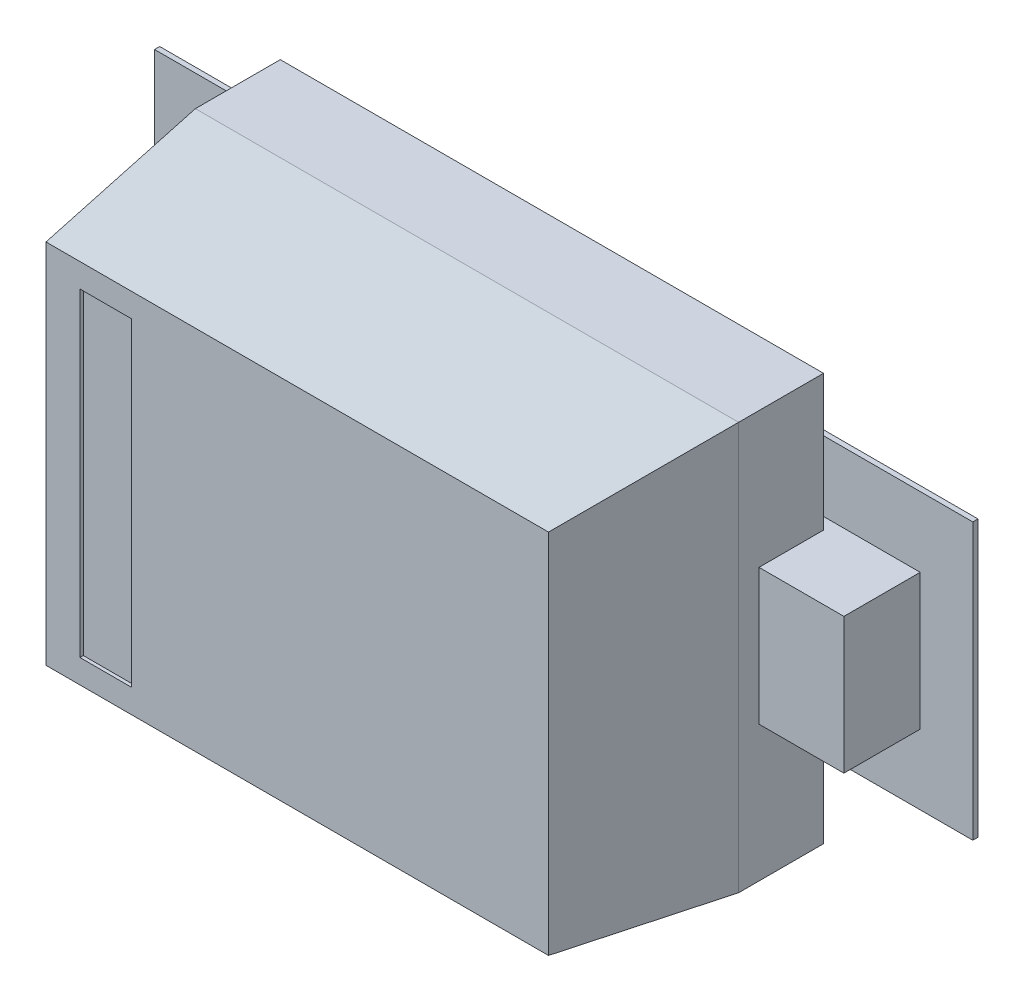
ISO-10303-21;
HEADER;
FILE_DESCRIPTION(('STEP AP214'),'2;1');
FILE_NAME('part.step','',(''),(''),'','','');
FILE_SCHEMA(('AUTOMOTIVE_DESIGN { 1 0 10303 214 1 1 1 1 }'));
ENDSEC;
DATA;
#1=APPLICATION_CONTEXT('core data for automotive mechanical design processes');
#2=APPLICATION_PROTOCOL_DEFINITION('international standard','automotive_design',2000,#1);
#3=PRODUCT_CONTEXT('',#1,'mechanical');
#4=PRODUCT('Part','Part','',(#3));
#5=PRODUCT_RELATED_PRODUCT_CATEGORY('part','',(#4));
#6=PRODUCT_DEFINITION_FORMATION('','',#4);
#7=PRODUCT_DEFINITION_CONTEXT('part definition',#1,'design');
#8=PRODUCT_DEFINITION('design','',#6,#7);
#9=PRODUCT_DEFINITION_SHAPE('','',#8);
#10=(LENGTH_UNIT() NAMED_UNIT(*) SI_UNIT(.MILLI.,.METRE.));
#11=(NAMED_UNIT(*) PLANE_ANGLE_UNIT() SI_UNIT($,.RADIAN.));
#12=(NAMED_UNIT(*) SI_UNIT($,.STERADIAN.) SOLID_ANGLE_UNIT());
#13=UNCERTAINTY_MEASURE_WITH_UNIT(LENGTH_MEASURE(1.E-05),#10,'distance_accuracy_value','');
#14=(GEOMETRIC_REPRESENTATION_CONTEXT(3) GLOBAL_UNCERTAINTY_ASSIGNED_CONTEXT((#13)) GLOBAL_UNIT_ASSIGNED_CONTEXT((#10,
#11,#12)) REPRESENTATION_CONTEXT('',''));
#15=CARTESIAN_POINT('',(0.,0.,0.));
#16=DIRECTION('',(0.,0.,1.));
#17=DIRECTION('',(1.,0.,0.));
#18=AXIS2_PLACEMENT_3D('',#15,#16,#17);
#19=CARTESIAN_POINT('',(-0.525,-0.1,0.0762));
#20=DIRECTION('',(-1.,0.,0.));
#21=DIRECTION('',(0.,0.,1.));
#22=AXIS2_PLACEMENT_3D('',#19,#20,#21);
#23=PLANE('',#22);
#24=DIRECTION('',(0.,1.,0.));
#25=VECTOR('',#24,1.);
#26=CARTESIAN_POINT('',(-0.525,-0.1,0.08382));
#27=LINE('',#26,#25);
#28=CARTESIAN_POINT('',(-0.525,-0.1,0.08382));
#29=VERTEX_POINT('',#28);
#30=CARTESIAN_POINT('',(-0.525,0.1,0.08382));
#31=VERTEX_POINT('',#30);
#32=EDGE_CURVE('E300',#29,#31,#27,.T.);
#33=ORIENTED_EDGE('',*,*,#32,.F.);
#34=DIRECTION('',(0.,0.,1.));
#35=VECTOR('',#34,1.);
#36=CARTESIAN_POINT('',(-0.525,-0.1,0.08382));
#37=LINE('',#36,#35);
#38=CARTESIAN_POINT('',(-0.525,-0.1,0.1962));
#39=VERTEX_POINT('',#38);
#40=EDGE_CURVE('E282',#29,#39,#37,.T.);
#41=ORIENTED_EDGE('',*,*,#40,.T.);
#42=DIRECTION('',(0.,1.,0.));
#43=VECTOR('',#42,1.);
#44=CARTESIAN_POINT('',(-0.525,-0.1,0.1962));
#45=LINE('',#44,#43);
#46=CARTESIAN_POINT('',(-0.525,0.1,0.1962));
#47=VERTEX_POINT('',#46);
#48=EDGE_CURVE('E11',#39,#47,#45,.T.);
#49=ORIENTED_EDGE('',*,*,#48,.T.);
#50=DIRECTION('',(0.,0.,1.));
#51=VECTOR('',#50,1.);
#52=CARTESIAN_POINT('',(-0.525,0.1,0.08382));
#53=LINE('',#52,#51);
#54=EDGE_CURVE('E106',#31,#47,#53,.T.);
#55=ORIENTED_EDGE('',*,*,#54,.F.);
#56=EDGE_LOOP('',(#33,#41,#49,#55));
#57=FACE_BOUND('',#56,.T.);
#58=ADVANCED_FACE('F17',(#57),#23,.T.);
#59=CARTESIAN_POINT('',(-0.525,-0.1,0.1962));
#60=DIRECTION('',(0.,0.,1.));
#61=DIRECTION('',(1.,0.,0.));
#62=AXIS2_PLACEMENT_3D('',#59,#60,#61);
#63=PLANE('',#62);
#64=DIRECTION('',(1.,0.,0.));
#65=VECTOR('',#64,1.);
#66=CARTESIAN_POINT('',(-0.525,-0.1,0.1962));
#67=LINE('',#66,#65);
#68=CARTESIAN_POINT('',(-0.4,-0.1,0.1962));
#69=VERTEX_POINT('',#68);
#70=EDGE_CURVE('E278',#39,#69,#67,.T.);
#71=ORIENTED_EDGE('',*,*,#70,.T.);
#72=DIRECTION('',(0.,1.,0.));
#73=VECTOR('',#72,1.);
#74=CARTESIAN_POINT('',(-0.4,-0.1,0.1962));
#75=LINE('',#74,#73);
#76=CARTESIAN_POINT('',(-0.4,0.1,0.1962));
#77=VERTEX_POINT('',#76);
#78=EDGE_CURVE('E389',#69,#77,#75,.T.);
#79=ORIENTED_EDGE('',*,*,#78,.T.);
#80=DIRECTION('',(1.,0.,0.));
#81=VECTOR('',#80,1.);
#82=CARTESIAN_POINT('',(-0.525,0.1,0.1962));
#83=LINE('',#82,#81);
#84=EDGE_CURVE('E433',#47,#77,#83,.T.);
#85=ORIENTED_EDGE('',*,*,#84,.F.);
#86=ORIENTED_EDGE('',*,*,#48,.F.);
#87=EDGE_LOOP('',(#71,#79,#85,#86));
#88=FACE_BOUND('',#87,.T.);
#89=ADVANCED_FACE('F567',(#88),#63,.T.);
#90=CARTESIAN_POINT('',(-0.325,-0.1,0.1962));
#91=DIRECTION('',(1.,0.,0.));
#92=DIRECTION('',(0.,1.,0.));
#93=AXIS2_PLACEMENT_3D('',#90,#91,#92);
#94=PLANE('',#93);
#95=DIRECTION('',(0.,1.,0.));
#96=VECTOR('',#95,1.);
#97=CARTESIAN_POINT('',(-0.325,-0.1,0.08382));
#98=LINE('',#97,#96);
#99=CARTESIAN_POINT('',(-0.325,-0.1,0.08382));
#100=VERTEX_POINT('',#99);
#101=CARTESIAN_POINT('',(-0.325,0.1,0.08382));
#102=VERTEX_POINT('',#101);
#103=EDGE_CURVE('E272',#100,#102,#98,.T.);
#104=ORIENTED_EDGE('',*,*,#103,.T.);
#105=DIRECTION('',(0.,0.,-1.));
#106=VECTOR('',#105,1.);
#107=CARTESIAN_POINT('',(-0.325,0.1,0.1012));
#108=LINE('',#107,#106);
#109=CARTESIAN_POINT('',(-0.325,0.1,0.1012));
#110=VERTEX_POINT('',#109);
#111=EDGE_CURVE('E28',#110,#102,#108,.T.);
#112=ORIENTED_EDGE('',*,*,#111,.F.);
#113=DIRECTION('',(0.,1.,0.));
#114=VECTOR('',#113,1.);
#115=CARTESIAN_POINT('',(-0.325,-0.1,0.1012));
#116=LINE('',#115,#114);
#117=CARTESIAN_POINT('',(-0.325,-0.1,0.1012));
#118=VERTEX_POINT('',#117);
#119=EDGE_CURVE('E437',#118,#110,#116,.T.);
#120=ORIENTED_EDGE('',*,*,#119,.F.);
#121=DIRECTION('',(0.,0.,-1.));
#122=VECTOR('',#121,1.);
#123=CARTESIAN_POINT('',(-0.325,-0.1,0.1012));
#124=LINE('',#123,#122);
#125=EDGE_CURVE('E283',#118,#100,#124,.T.);
#126=ORIENTED_EDGE('',*,*,#125,.T.);
#127=EDGE_LOOP('',(#104,#112,#120,#126));
#128=FACE_BOUND('',#127,.T.);
#129=ADVANCED_FACE('F640',(#128),#94,.T.);
#130=CARTESIAN_POINT('',(0.325,-0.1,0.0762));
#131=DIRECTION('',(-1.,0.,0.));
#132=DIRECTION('',(0.,0.,1.));
#133=AXIS2_PLACEMENT_3D('',#130,#131,#132);
#134=PLANE('',#133);
#135=DIRECTION('',(0.,1.,0.));
#136=VECTOR('',#135,1.);
#137=CARTESIAN_POINT('',(0.325,-0.1,0.08382));
#138=LINE('',#137,#136);
#139=CARTESIAN_POINT('',(0.325,-0.1,0.08382));
#140=VERTEX_POINT('',#139);
#141=CARTESIAN_POINT('',(0.325,0.1,0.08382));
#142=VERTEX_POINT('',#141);
#143=EDGE_CURVE('E324',#140,#142,#138,.T.);
#144=ORIENTED_EDGE('',*,*,#143,.F.);
#145=DIRECTION('',(0.,0.,1.));
#146=VECTOR('',#145,1.);
#147=CARTESIAN_POINT('',(0.325,-0.1,0.08382));
#148=LINE('',#147,#146);
#149=CARTESIAN_POINT('',(0.325,-0.1,0.1012));
#150=VERTEX_POINT('',#149);
#151=EDGE_CURVE('E328',#140,#150,#148,.T.);
#152=ORIENTED_EDGE('',*,*,#151,.T.);
#153=DIRECTION('',(0.,1.,0.));
#154=VECTOR('',#153,1.);
#155=CARTESIAN_POINT('',(0.325,-0.1,0.1012));
#156=LINE('',#155,#154);
#157=CARTESIAN_POINT('',(0.325,0.1,0.1012));
#158=VERTEX_POINT('',#157);
#159=EDGE_CURVE('E443',#150,#158,#156,.T.);
#160=ORIENTED_EDGE('',*,*,#159,.T.);
#161=DIRECTION('',(0.,0.,1.));
#162=VECTOR('',#161,1.);
#163=CARTESIAN_POINT('',(0.325,0.1,0.08382));
#164=LINE('',#163,#162);
#165=EDGE_CURVE('E366',#142,#158,#164,.T.);
#166=ORIENTED_EDGE('',*,*,#165,.F.);
#167=EDGE_LOOP('',(#144,#152,#160,#166));
#168=FACE_BOUND('',#167,.T.);
#169=ADVANCED_FACE('F666',(#168),#134,.T.);
#170=CARTESIAN_POINT('',(0.,0.1,0.));
#171=DIRECTION('',(0.,1.,0.));
#172=DIRECTION('',(1.,0.,0.));
#173=AXIS2_PLACEMENT_3D('',#170,#171,#172);
#174=PLANE('',#173);
#175=DIRECTION('',(-1.,0.,0.));
#176=VECTOR('',#175,1.);
#177=CARTESIAN_POINT('',(-0.325,0.1,0.08382));
#178=LINE('',#177,#176);
#179=EDGE_CURVE('E304',#102,#31,#178,.T.);
#180=ORIENTED_EDGE('',*,*,#179,.T.);
#181=ORIENTED_EDGE('',*,*,#54,.T.);
#182=ORIENTED_EDGE('',*,*,#84,.T.);
#183=DIRECTION('',(0.,0.,1.));
#184=VECTOR('',#183,1.);
#185=CARTESIAN_POINT('',(-0.4,0.1,0.1012));
#186=LINE('',#185,#184);
#187=CARTESIAN_POINT('',(-0.4,0.1,0.1012));
#188=VERTEX_POINT('',#187);
#189=EDGE_CURVE('E266',#188,#77,#186,.T.);
#190=ORIENTED_EDGE('',*,*,#189,.F.);
#191=DIRECTION('',(1.,0.,0.));
#192=VECTOR('',#191,1.);
#193=CARTESIAN_POINT('',(-0.4,0.1,0.1012));
#194=LINE('',#193,#192);
#195=EDGE_CURVE('E442',#188,#110,#194,.T.);
#196=ORIENTED_EDGE('',*,*,#195,.T.);
#197=ORIENTED_EDGE('',*,*,#111,.T.);
#198=EDGE_LOOP('',(#180,#181,#182,#190,#196,#197));
#199=FACE_BOUND('',#198,.T.);
#200=ADVANCED_FACE('F663',(#199),#174,.T.);
#201=CARTESIAN_POINT('',(0.,0.1,0.));
#202=DIRECTION('',(0.,1.,0.));
#203=DIRECTION('',(1.,0.,0.));
#204=AXIS2_PLACEMENT_3D('',#201,#202,#203);
#205=PLANE('',#204);
#206=DIRECTION('',(-1.,0.,0.));
#207=VECTOR('',#206,1.);
#208=CARTESIAN_POINT('',(0.525,0.1,0.08382));
#209=LINE('',#208,#207);
#210=CARTESIAN_POINT('',(0.525,0.1,0.08382));
#211=VERTEX_POINT('',#210);
#212=EDGE_CURVE('E311',#211,#142,#209,.T.);
#213=ORIENTED_EDGE('',*,*,#212,.T.);
#214=ORIENTED_EDGE('',*,*,#165,.T.);
#215=DIRECTION('',(1.,0.,0.));
#216=VECTOR('',#215,1.);
#217=CARTESIAN_POINT('',(0.325,0.1,0.1012));
#218=LINE('',#217,#216);
#219=CARTESIAN_POINT('',(0.4,0.1,0.1012));
#220=VERTEX_POINT('',#219);
#221=EDGE_CURVE('E448',#158,#220,#218,.T.);
#222=ORIENTED_EDGE('',*,*,#221,.T.);
#223=DIRECTION('',(0.,0.,-1.));
#224=VECTOR('',#223,1.);
#225=CARTESIAN_POINT('',(0.4,0.1,0.1962));
#226=LINE('',#225,#224);
#227=CARTESIAN_POINT('',(0.4,0.1,0.1962));
#228=VERTEX_POINT('',#227);
#229=EDGE_CURVE('E216',#228,#220,#226,.T.);
#230=ORIENTED_EDGE('',*,*,#229,.F.);
#231=DIRECTION('',(1.,0.,0.));
#232=VECTOR('',#231,1.);
#233=CARTESIAN_POINT('',(0.4,0.1,0.1962));
#234=LINE('',#233,#232);
#235=CARTESIAN_POINT('',(0.525,0.1,0.1962));
#236=VERTEX_POINT('',#235);
#237=EDGE_CURVE('E398',#228,#236,#234,.T.);
#238=ORIENTED_EDGE('',*,*,#237,.T.);
#239=DIRECTION('',(0.,0.,-1.));
#240=VECTOR('',#239,1.);
#241=CARTESIAN_POINT('',(0.525,0.1,0.1962));
#242=LINE('',#241,#240);
#243=EDGE_CURVE('E348',#236,#211,#242,.T.);
#244=ORIENTED_EDGE('',*,*,#243,.T.);
#245=EDGE_LOOP('',(#213,#214,#222,#230,#238,#244));
#246=FACE_BOUND('',#245,.T.);
#247=ADVANCED_FACE('F649',(#246),#205,.T.);
#248=CARTESIAN_POINT('',(0.,0.3,0.));
#249=DIRECTION('',(0.,1.,0.));
#250=DIRECTION('',(1.,0.,0.));
#251=AXIS2_PLACEMENT_3D('',#248,#249,#250);
#252=PLANE('',#251);
#253=DIRECTION('',(1.,0.,0.));
#254=VECTOR('',#253,1.);
#255=CARTESIAN_POINT('',(-0.4,0.3,0.2262));
#256=LINE('',#255,#254);
#257=CARTESIAN_POINT('',(-0.4,0.3,0.2262));
#258=VERTEX_POINT('',#257);
#259=CARTESIAN_POINT('',(0.4,0.3,0.2262));
#260=VERTEX_POINT('',#259);
#261=EDGE_CURVE('E358',#258,#260,#256,.T.);
#262=ORIENTED_EDGE('',*,*,#261,.T.);
#263=DIRECTION('',(0.,0.,-1.));
#264=VECTOR('',#263,1.);
#265=CARTESIAN_POINT('',(0.4,0.3,0.2262));
#266=LINE('',#265,#264);
#267=CARTESIAN_POINT('',(0.4,0.3,0.1012));
#268=VERTEX_POINT('',#267);
#269=EDGE_CURVE('E212',#260,#268,#266,.T.);
#270=ORIENTED_EDGE('',*,*,#269,.T.);
#271=DIRECTION('',(-1.,0.,0.));
#272=VECTOR('',#271,1.);
#273=CARTESIAN_POINT('',(0.4,0.3,0.1012));
#274=LINE('',#273,#272);
#275=CARTESIAN_POINT('',(-0.4,0.3,0.1012));
#276=VERTEX_POINT('',#275);
#277=EDGE_CURVE('E438',#268,#276,#274,.T.);
#278=ORIENTED_EDGE('',*,*,#277,.T.);
#279=DIRECTION('',(0.,0.,1.));
#280=VECTOR('',#279,1.);
#281=CARTESIAN_POINT('',(-0.4,0.3,0.1012));
#282=LINE('',#281,#280);
#283=EDGE_CURVE('E260',#276,#258,#282,.T.);
#284=ORIENTED_EDGE('',*,*,#283,.T.);
#285=EDGE_LOOP('',(#262,#270,#278,#284));
#286=FACE_BOUND('',#285,.T.);
#287=ADVANCED_FACE('F645',(#286),#252,.T.);
#288=CARTESIAN_POINT('',(0.,0.285,0.3512));
#289=DIRECTION('',(0.,0.992876838486925,0.119145220618403));
#290=DIRECTION('',(1.,0.,0.));
#291=AXIS2_PLACEMENT_3D('',#288,#289,#290);
#292=PLANE('',#291);
#293=ORIENTED_EDGE('',*,*,#261,.F.);
#294=DIRECTION('',(-0.118308451008796,0.118308451008796,-0.985903758406366));
#295=VECTOR('',#294,1.);
#296=CARTESIAN_POINT('',(-0.37,0.27,0.4762));
#297=LINE('',#296,#295);
#298=CARTESIAN_POINT('',(-0.37,0.27,0.4762));
#299=VERTEX_POINT('',#298);
#300=EDGE_CURVE('E261',#299,#258,#297,.T.);
#301=ORIENTED_EDGE('',*,*,#300,.F.);
#302=DIRECTION('',(1.,0.,0.));
#303=VECTOR('',#302,1.);
#304=CARTESIAN_POINT('',(-0.37,0.27,0.4762));
#305=LINE('',#304,#303);
#306=CARTESIAN_POINT('',(0.37,0.27,0.4762));
#307=VERTEX_POINT('',#306);
#308=EDGE_CURVE('E255',#299,#307,#305,.T.);
#309=ORIENTED_EDGE('',*,*,#308,.T.);
#310=DIRECTION('',(0.118308451008796,0.118308451008796,-0.985903758406366));
#311=VECTOR('',#310,1.);
#312=CARTESIAN_POINT('',(0.37,0.27,0.4762));
#313=LINE('',#312,#311);
#314=EDGE_CURVE('E355',#307,#260,#313,.T.);
#315=ORIENTED_EDGE('',*,*,#314,.T.);
#316=EDGE_LOOP('',(#293,#301,#309,#315));
#317=FACE_BOUND('',#316,.T.);
#318=ADVANCED_FACE('F648',(#317),#292,.T.);
#319=CARTESIAN_POINT('',(0.385,0.,0.3512));
#320=DIRECTION('',(0.992876838486925,0.,0.119145220618403));
#321=DIRECTION('',(0.,-1.,0.));
#322=AXIS2_PLACEMENT_3D('',#319,#320,#321);
#323=PLANE('',#322);
#324=DIRECTION('',(0.,-1.,0.));
#325=VECTOR('',#324,1.);
#326=CARTESIAN_POINT('',(0.4,0.3,0.2262));
#327=LINE('',#326,#325);
#328=CARTESIAN_POINT('',(0.4,-0.3,0.2262));
#329=VERTEX_POINT('',#328);
#330=EDGE_CURVE('E204',#260,#329,#327,.T.);
#331=ORIENTED_EDGE('',*,*,#330,.F.);
#332=ORIENTED_EDGE('',*,*,#314,.F.);
#333=DIRECTION('',(0.,-1.,0.));
#334=VECTOR('',#333,1.);
#335=CARTESIAN_POINT('',(0.37,0.27,0.4762));
#336=LINE('',#335,#334);
#337=CARTESIAN_POINT('',(0.37,-0.27,0.4762));
#338=VERTEX_POINT('',#337);
#339=EDGE_CURVE('E223',#307,#338,#336,.T.);
#340=ORIENTED_EDGE('',*,*,#339,.T.);
#341=DIRECTION('',(0.118308451008796,-0.118308451008796,-0.985903758406366));
#342=VECTOR('',#341,1.);
#343=CARTESIAN_POINT('',(0.37,-0.27,0.4762));
#344=LINE('',#343,#342);
#345=EDGE_CURVE('E220',#338,#329,#344,.T.);
#346=ORIENTED_EDGE('',*,*,#345,.T.);
#347=EDGE_LOOP('',(#331,#332,#340,#346));
#348=FACE_BOUND('',#347,.T.);
#349=ADVANCED_FACE('F221',(#348),#323,.T.);
#350=CARTESIAN_POINT('',(0.4,-0.3,0.4762));
#351=DIRECTION('',(1.,0.,0.));
#352=DIRECTION('',(0.,1.,0.));
#353=AXIS2_PLACEMENT_3D('',#350,#351,#352);
#354=PLANE('',#353);
#355=ORIENTED_EDGE('',*,*,#330,.T.);
#356=DIRECTION('',(0.,0.,-1.));
#357=VECTOR('',#356,1.);
#358=CARTESIAN_POINT('',(0.4,-0.3,0.2262));
#359=LINE('',#358,#357);
#360=CARTESIAN_POINT('',(0.4,-0.3,0.1012));
#361=VERTEX_POINT('',#360);
#362=EDGE_CURVE('E209',#329,#361,#359,.T.);
#363=ORIENTED_EDGE('',*,*,#362,.T.);
#364=DIRECTION('',(0.,1.,0.));
#365=VECTOR('',#364,1.);
#366=CARTESIAN_POINT('',(0.4,-0.3,0.1012));
#367=LINE('',#366,#365);
#368=CARTESIAN_POINT('',(0.4,-0.1,0.1012));
#369=VERTEX_POINT('',#368);
#370=EDGE_CURVE('E461',#361,#369,#367,.T.);
#371=ORIENTED_EDGE('',*,*,#370,.T.);
#372=DIRECTION('',(0.,0.,-1.));
#373=VECTOR('',#372,1.);
#374=CARTESIAN_POINT('',(0.4,-0.1,0.1962));
#375=LINE('',#374,#373);
#376=CARTESIAN_POINT('',(0.4,-0.1,0.1962));
#377=VERTEX_POINT('',#376);
#378=EDGE_CURVE('E332',#377,#369,#375,.T.);
#379=ORIENTED_EDGE('',*,*,#378,.F.);
#380=DIRECTION('',(0.,1.,0.));
#381=VECTOR('',#380,1.);
#382=CARTESIAN_POINT('',(0.4,-0.1,0.1962));
#383=LINE('',#382,#381);
#384=EDGE_CURVE('E217',#377,#228,#383,.T.);
#385=ORIENTED_EDGE('',*,*,#384,.T.);
#386=ORIENTED_EDGE('',*,*,#229,.T.);
#387=DIRECTION('',(0.,1.,0.));
#388=VECTOR('',#387,1.);
#389=CARTESIAN_POINT('',(0.4,0.1,0.1012));
#390=LINE('',#389,#388);
#391=EDGE_CURVE('E441',#220,#268,#390,.T.);
#392=ORIENTED_EDGE('',*,*,#391,.T.);
#393=ORIENTED_EDGE('',*,*,#269,.F.);
#394=EDGE_LOOP('',(#355,#363,#371,#379,#385,#386,#392,#393));
#395=FACE_BOUND('',#394,.T.);
#396=ADVANCED_FACE('F206',(#395),#354,.T.);
#397=CARTESIAN_POINT('',(0.325,-0.1,0.1962));
#398=DIRECTION('',(0.,0.,1.));
#399=DIRECTION('',(1.,0.,0.));
#400=AXIS2_PLACEMENT_3D('',#397,#398,#399);
#401=PLANE('',#400);
#402=DIRECTION('',(1.,0.,0.));
#403=VECTOR('',#402,1.);
#404=CARTESIAN_POINT('',(0.4,-0.1,0.1962));
#405=LINE('',#404,#403);
#406=CARTESIAN_POINT('',(0.525,-0.1,0.1962));
#407=VERTEX_POINT('',#406);
#408=EDGE_CURVE('E295',#377,#407,#405,.T.);
#409=ORIENTED_EDGE('',*,*,#408,.T.);
#410=DIRECTION('',(0.,1.,0.));
#411=VECTOR('',#410,1.);
#412=CARTESIAN_POINT('',(0.525,-0.1,0.1962));
#413=LINE('',#412,#411);
#414=EDGE_CURVE('E401',#407,#236,#413,.T.);
#415=ORIENTED_EDGE('',*,*,#414,.T.);
#416=ORIENTED_EDGE('',*,*,#237,.F.);
#417=ORIENTED_EDGE('',*,*,#384,.F.);
#418=EDGE_LOOP('',(#409,#415,#416,#417));
#419=FACE_BOUND('',#418,.T.);
#420=ADVANCED_FACE('F652',(#419),#401,.T.);
#421=CARTESIAN_POINT('',(0.525,-0.1,0.1962));
#422=DIRECTION('',(1.,0.,0.));
#423=DIRECTION('',(0.,1.,0.));
#424=AXIS2_PLACEMENT_3D('',#421,#422,#423);
#425=PLANE('',#424);
#426=DIRECTION('',(0.,1.,0.));
#427=VECTOR('',#426,1.);
#428=CARTESIAN_POINT('',(0.525,-0.1,0.08382));
#429=LINE('',#428,#427);
#430=CARTESIAN_POINT('',(0.525,-0.1,0.08382));
#431=VERTEX_POINT('',#430);
#432=EDGE_CURVE('E306',#431,#211,#429,.T.);
#433=ORIENTED_EDGE('',*,*,#432,.T.);
#434=ORIENTED_EDGE('',*,*,#243,.F.);
#435=ORIENTED_EDGE('',*,*,#414,.F.);
#436=DIRECTION('',(0.,0.,-1.));
#437=VECTOR('',#436,1.);
#438=CARTESIAN_POINT('',(0.525,-0.1,0.1962));
#439=LINE('',#438,#437);
#440=EDGE_CURVE('E291',#407,#431,#439,.T.);
#441=ORIENTED_EDGE('',*,*,#440,.T.);
#442=EDGE_LOOP('',(#433,#434,#435,#441));
#443=FACE_BOUND('',#442,.T.);
#444=ADVANCED_FACE('F630',(#443),#425,.T.);
#445=CARTESIAN_POINT('',(-0.2975102,-0.2029968,0.0762));
#446=DIRECTION('',(1.,0.,0.));
#447=DIRECTION('',(0.,1.,0.));
#448=AXIS2_PLACEMENT_3D('',#445,#446,#447);
#449=PLANE('',#448);
#450=DIRECTION('',(0.,1.,0.));
#451=VECTOR('',#450,1.);
#452=CARTESIAN_POINT('',(-0.2975102,-0.2029968,0.0762));
#453=LINE('',#452,#451);
#454=CARTESIAN_POINT('',(-0.2975102,-0.2029968,0.0762));
#455=VERTEX_POINT('',#454);
#456=CARTESIAN_POINT('',(-0.2975102,0.2029968,0.0762));
#457=VERTEX_POINT('',#456);
#458=EDGE_CURVE('E316',#455,#457,#453,.T.);
#459=ORIENTED_EDGE('',*,*,#458,.T.);
#460=DIRECTION('',(0.,0.,1.));
#461=VECTOR('',#460,1.);
#462=CARTESIAN_POINT('',(-0.2975102,0.2029968,0.0762));
#463=LINE('',#462,#461);
#464=CARTESIAN_POINT('',(-0.2975102,0.2029968,0.08382));
#465=VERTEX_POINT('',#464);
#466=EDGE_CURVE('E337',#457,#465,#463,.T.);
#467=ORIENTED_EDGE('',*,*,#466,.T.);
#468=DIRECTION('',(0.,1.,0.));
#469=VECTOR('',#468,1.);
#470=CARTESIAN_POINT('',(-0.2975102,-0.2029968,0.08382));
#471=LINE('',#470,#469);
#472=CARTESIAN_POINT('',(-0.2975102,-0.2029968,0.08382));
#473=VERTEX_POINT('',#472);
#474=EDGE_CURVE('E305',#473,#465,#471,.T.);
#475=ORIENTED_EDGE('',*,*,#474,.F.);
#476=DIRECTION('',(0.,0.,1.));
#477=VECTOR('',#476,1.);
#478=CARTESIAN_POINT('',(-0.2975102,-0.2029968,0.0762));
#479=LINE('',#478,#477);
#480=EDGE_CURVE('E123',#455,#473,#479,.T.);
#481=ORIENTED_EDGE('',*,*,#480,.F.);
#482=EDGE_LOOP('',(#459,#467,#475,#481));
#483=FACE_BOUND('',#482,.T.);
#484=ADVANCED_FACE('F605',(#483),#449,.T.);
#485=CARTESIAN_POINT('',(-0.602488,-0.2029968,0.0762));
#486=DIRECTION('',(0.,-1.,0.));
#487=DIRECTION('',(0.,0.,-1.));
#488=AXIS2_PLACEMENT_3D('',#485,#486,#487);
#489=PLANE('',#488);
#490=DIRECTION('',(1.,0.,0.));
#491=VECTOR('',#490,1.);
#492=CARTESIAN_POINT('',(-0.602488,-0.2029968,0.0762));
#493=LINE('',#492,#491);
#494=CARTESIAN_POINT('',(-0.602488,-0.2029968,0.0762));
#495=VERTEX_POINT('',#494);
#496=EDGE_CURVE('E385',#495,#455,#493,.T.);
#497=ORIENTED_EDGE('',*,*,#496,.T.);
#498=ORIENTED_EDGE('',*,*,#480,.T.);
#499=DIRECTION('',(1.,0.,0.));
#500=VECTOR('',#499,1.);
#501=CARTESIAN_POINT('',(-0.602488,-0.2029968,0.08382));
#502=LINE('',#501,#500);
#503=CARTESIAN_POINT('',(-0.602488,-0.2029968,0.08382));
#504=VERTEX_POINT('',#503);
#505=EDGE_CURVE('E381',#504,#473,#502,.T.);
#506=ORIENTED_EDGE('',*,*,#505,.F.);
#507=DIRECTION('',(0.,0.,1.));
#508=VECTOR('',#507,1.);
#509=CARTESIAN_POINT('',(-0.602488,-0.2029968,0.0762));
#510=LINE('',#509,#508);
#511=EDGE_CURVE('E349',#495,#504,#510,.T.);
#512=ORIENTED_EDGE('',*,*,#511,.F.);
#513=EDGE_LOOP('',(#497,#498,#506,#512));
#514=FACE_BOUND('',#513,.T.);
#515=ADVANCED_FACE('F620',(#514),#489,.T.);
#516=CARTESIAN_POINT('',(-0.602488,0.2029968,0.0762));
#517=DIRECTION('',(-1.,0.,0.));
#518=DIRECTION('',(0.,0.,1.));
#519=AXIS2_PLACEMENT_3D('',#516,#517,#518);
#520=PLANE('',#519);
#521=DIRECTION('',(0.,-1.,0.));
#522=VECTOR('',#521,1.);
#523=CARTESIAN_POINT('',(-0.602488,0.2029968,0.0762));
#524=LINE('',#523,#522);
#525=CARTESIAN_POINT('',(-0.602488,0.2029968,0.0762));
#526=VERTEX_POINT('',#525);
#527=EDGE_CURVE('E388',#526,#495,#524,.T.);
#528=ORIENTED_EDGE('',*,*,#527,.T.);
#529=ORIENTED_EDGE('',*,*,#511,.T.);
#530=DIRECTION('',(0.,-1.,0.));
#531=VECTOR('',#530,1.);
#532=CARTESIAN_POINT('',(-0.602488,0.2029968,0.08382));
#533=LINE('',#532,#531);
#534=CARTESIAN_POINT('',(-0.602488,0.2029968,0.08382));
#535=VERTEX_POINT('',#534);
#536=EDGE_CURVE('E341',#535,#504,#533,.T.);
#537=ORIENTED_EDGE('',*,*,#536,.F.);
#538=DIRECTION('',(0.,0.,1.));
#539=VECTOR('',#538,1.);
#540=CARTESIAN_POINT('',(-0.602488,0.2029968,0.0762));
#541=LINE('',#540,#539);
#542=EDGE_CURVE('E333',#526,#535,#541,.T.);
#543=ORIENTED_EDGE('',*,*,#542,.F.);
#544=EDGE_LOOP('',(#528,#529,#537,#543));
#545=FACE_BOUND('',#544,.T.);
#546=ADVANCED_FACE('F618',(#545),#520,.T.);
#547=CARTESIAN_POINT('',(0.2975102,0.2029968,0.0762));
#548=DIRECTION('',(-1.,0.,0.));
#549=DIRECTION('',(0.,0.,1.));
#550=AXIS2_PLACEMENT_3D('',#547,#548,#549);
#551=PLANE('',#550);
#552=DIRECTION('',(0.,-1.,0.));
#553=VECTOR('',#552,1.);
#554=CARTESIAN_POINT('',(0.2975102,0.2029968,0.0762));
#555=LINE('',#554,#553);
#556=CARTESIAN_POINT('',(0.2975102,0.2029968,0.0762));
#557=VERTEX_POINT('',#556);
#558=CARTESIAN_POINT('',(0.2975102,-0.2029968,0.0762));
#559=VERTEX_POINT('',#558);
#560=EDGE_CURVE('E312',#557,#559,#555,.T.);
#561=ORIENTED_EDGE('',*,*,#560,.T.);
#562=DIRECTION('',(0.,0.,1.));
#563=VECTOR('',#562,1.);
#564=CARTESIAN_POINT('',(0.2975102,-0.2029968,0.0762));
#565=LINE('',#564,#563);
#566=CARTESIAN_POINT('',(0.2975102,-0.2029968,0.08382));
#567=VERTEX_POINT('',#566);
#568=EDGE_CURVE('E465',#559,#567,#565,.T.);
#569=ORIENTED_EDGE('',*,*,#568,.T.);
#570=DIRECTION('',(0.,-1.,0.));
#571=VECTOR('',#570,1.);
#572=CARTESIAN_POINT('',(0.2975102,0.2029968,0.08382));
#573=LINE('',#572,#571);
#574=CARTESIAN_POINT('',(0.2975102,0.2029968,0.08382));
#575=VERTEX_POINT('',#574);
#576=EDGE_CURVE('E271',#575,#567,#573,.T.);
#577=ORIENTED_EDGE('',*,*,#576,.F.);
#578=DIRECTION('',(0.,0.,1.));
#579=VECTOR('',#578,1.);
#580=CARTESIAN_POINT('',(0.2975102,0.2029968,0.0762));
#581=LINE('',#580,#579);
#582=EDGE_CURVE('E21',#557,#575,#581,.T.);
#583=ORIENTED_EDGE('',*,*,#582,.F.);
#584=EDGE_LOOP('',(#561,#569,#577,#583));
#585=FACE_BOUND('',#584,.T.);
#586=ADVANCED_FACE('F629',(#585),#551,.T.);
#587=CARTESIAN_POINT('',(0.2975102,-0.2029968,0.0762));
#588=DIRECTION('',(0.,-1.,0.));
#589=DIRECTION('',(0.,0.,-1.));
#590=AXIS2_PLACEMENT_3D('',#587,#588,#589);
#591=PLANE('',#590);
#592=DIRECTION('',(1.,0.,0.));
#593=VECTOR('',#592,1.);
#594=CARTESIAN_POINT('',(0.2975102,-0.2029968,0.0762));
#595=LINE('',#594,#593);
#596=CARTESIAN_POINT('',(0.602488,-0.2029968,0.0762));
#597=VERTEX_POINT('',#596);
#598=EDGE_CURVE('E317',#559,#597,#595,.T.);
#599=ORIENTED_EDGE('',*,*,#598,.T.);
#600=DIRECTION('',(0.,0.,1.));
#601=VECTOR('',#600,1.);
#602=CARTESIAN_POINT('',(0.602488,-0.2029968,0.0762));
#603=LINE('',#602,#601);
#604=CARTESIAN_POINT('',(0.602488,-0.2029968,0.08382));
#605=VERTEX_POINT('',#604);
#606=EDGE_CURVE('E345',#597,#605,#603,.T.);
#607=ORIENTED_EDGE('',*,*,#606,.T.);
#608=DIRECTION('',(1.,0.,0.));
#609=VECTOR('',#608,1.);
#610=CARTESIAN_POINT('',(0.2975102,-0.2029968,0.08382));
#611=LINE('',#610,#609);
#612=EDGE_CURVE('E273',#567,#605,#611,.T.);
#613=ORIENTED_EDGE('',*,*,#612,.F.);
#614=ORIENTED_EDGE('',*,*,#568,.F.);
#615=EDGE_LOOP('',(#599,#607,#613,#614));
#616=FACE_BOUND('',#615,.T.);
#617=ADVANCED_FACE('F658',(#616),#591,.T.);
#618=CARTESIAN_POINT('',(0.602488,-0.2029968,0.0762));
#619=DIRECTION('',(1.,0.,0.));
#620=DIRECTION('',(0.,1.,0.));
#621=AXIS2_PLACEMENT_3D('',#618,#619,#620);
#622=PLANE('',#621);
#623=DIRECTION('',(0.,1.,0.));
#624=VECTOR('',#623,1.);
#625=CARTESIAN_POINT('',(0.602488,-0.2029968,0.0762));
#626=LINE('',#625,#624);
#627=CARTESIAN_POINT('',(0.602488,0.2029968,0.0762));
#628=VERTEX_POINT('',#627);
#629=EDGE_CURVE('E452',#597,#628,#626,.T.);
#630=ORIENTED_EDGE('',*,*,#629,.T.);
#631=DIRECTION('',(0.,0.,1.));
#632=VECTOR('',#631,1.);
#633=CARTESIAN_POINT('',(0.602488,0.2029968,0.0762));
#634=LINE('',#633,#632);
#635=CARTESIAN_POINT('',(0.602488,0.2029968,0.08382));
#636=VERTEX_POINT('',#635);
#637=EDGE_CURVE('E342',#628,#636,#634,.T.);
#638=ORIENTED_EDGE('',*,*,#637,.T.);
#639=DIRECTION('',(0.,1.,0.));
#640=VECTOR('',#639,1.);
#641=CARTESIAN_POINT('',(0.602488,-0.2029968,0.08382));
#642=LINE('',#641,#640);
#643=EDGE_CURVE('E277',#605,#636,#642,.T.);
#644=ORIENTED_EDGE('',*,*,#643,.F.);
#645=ORIENTED_EDGE('',*,*,#606,.F.);
#646=EDGE_LOOP('',(#630,#638,#644,#645));
#647=FACE_BOUND('',#646,.T.);
#648=ADVANCED_FACE('F661',(#647),#622,.T.);
#649=CARTESIAN_POINT('',(0.602488,0.2029968,0.0762));
#650=DIRECTION('',(0.,1.,0.));
#651=DIRECTION('',(1.,0.,0.));
#652=AXIS2_PLACEMENT_3D('',#649,#650,#651);
#653=PLANE('',#652);
#654=DIRECTION('',(-1.,0.,0.));
#655=VECTOR('',#654,1.);
#656=CARTESIAN_POINT('',(0.602488,0.2029968,0.0762));
#657=LINE('',#656,#655);
#658=EDGE_CURVE('E518',#628,#557,#657,.T.);
#659=ORIENTED_EDGE('',*,*,#658,.T.);
#660=ORIENTED_EDGE('',*,*,#582,.T.);
#661=DIRECTION('',(-1.,0.,0.));
#662=VECTOR('',#661,1.);
#663=CARTESIAN_POINT('',(0.602488,0.2029968,0.08382));
#664=LINE('',#663,#662);
#665=EDGE_CURVE('E267',#636,#575,#664,.T.);
#666=ORIENTED_EDGE('',*,*,#665,.F.);
#667=ORIENTED_EDGE('',*,*,#637,.F.);
#668=EDGE_LOOP('',(#659,#660,#666,#667));
#669=FACE_BOUND('',#668,.T.);
#670=ADVANCED_FACE('F693',(#669),#653,.T.);
#671=CARTESIAN_POINT('',(-0.325,-0.1,0.0762));
#672=DIRECTION('',(0.,0.,-1.));
#673=DIRECTION('',(0.,-1.,0.));
#674=AXIS2_PLACEMENT_3D('',#671,#672,#673);
#675=PLANE('',#674);
#676=DIRECTION('',(-1.,0.,0.));
#677=VECTOR('',#676,1.);
#678=CARTESIAN_POINT('',(-0.2975102,0.2029968,0.0762));
#679=LINE('',#678,#677);
#680=EDGE_CURVE('E310',#457,#526,#679,.T.);
#681=ORIENTED_EDGE('',*,*,#680,.F.);
#682=ORIENTED_EDGE('',*,*,#458,.F.);
#683=ORIENTED_EDGE('',*,*,#496,.F.);
#684=ORIENTED_EDGE('',*,*,#527,.F.);
#685=EDGE_LOOP('',(#681,#682,#683,#684));
#686=FACE_BOUND('',#685,.T.);
#687=ADVANCED_FACE('F19',(#686),#675,.T.);
#688=CARTESIAN_POINT('',(-0.325,-0.1,0.0762));
#689=DIRECTION('',(0.,0.,-1.));
#690=DIRECTION('',(0.,-1.,0.));
#691=AXIS2_PLACEMENT_3D('',#688,#689,#690);
#692=PLANE('',#691);
#693=ORIENTED_EDGE('',*,*,#658,.F.);
#694=ORIENTED_EDGE('',*,*,#629,.F.);
#695=ORIENTED_EDGE('',*,*,#598,.F.);
#696=ORIENTED_EDGE('',*,*,#560,.F.);
#697=EDGE_LOOP('',(#693,#694,#695,#696));
#698=FACE_BOUND('',#697,.T.);
#699=ADVANCED_FACE('F725',(#698),#692,.T.);
#700=CARTESIAN_POINT('',(-0.2975102,0.2029968,0.0762));
#701=DIRECTION('',(0.,1.,0.));
#702=DIRECTION('',(1.,0.,0.));
#703=AXIS2_PLACEMENT_3D('',#700,#701,#702);
#704=PLANE('',#703);
#705=ORIENTED_EDGE('',*,*,#680,.T.);
#706=ORIENTED_EDGE('',*,*,#542,.T.);
#707=DIRECTION('',(-1.,0.,0.));
#708=VECTOR('',#707,1.);
#709=CARTESIAN_POINT('',(-0.2975102,0.2029968,0.08382));
#710=LINE('',#709,#708);
#711=EDGE_CURVE('E299',#465,#535,#710,.T.);
#712=ORIENTED_EDGE('',*,*,#711,.F.);
#713=ORIENTED_EDGE('',*,*,#466,.F.);
#714=EDGE_LOOP('',(#705,#706,#712,#713));
#715=FACE_BOUND('',#714,.T.);
#716=ADVANCED_FACE('F612',(#715),#704,.T.);
#717=CARTESIAN_POINT('',(0.,0.,0.08382));
#718=DIRECTION('',(0.,0.,1.));
#719=DIRECTION('',(1.,0.,0.));
#720=AXIS2_PLACEMENT_3D('',#717,#718,#719);
#721=PLANE('',#720);
#722=DIRECTION('',(-1.,0.,0.));
#723=VECTOR('',#722,1.);
#724=CARTESIAN_POINT('',(0.525,-0.1,0.08382));
#725=LINE('',#724,#723);
#726=EDGE_CURVE('E296',#431,#140,#725,.T.);
#727=ORIENTED_EDGE('',*,*,#726,.T.);
#728=ORIENTED_EDGE('',*,*,#143,.T.);
#729=ORIENTED_EDGE('',*,*,#212,.F.);
#730=ORIENTED_EDGE('',*,*,#432,.F.);
#731=EDGE_LOOP('',(#727,#728,#729,#730));
#732=FACE_BOUND('',#731,.T.);
#733=ORIENTED_EDGE('',*,*,#665,.T.);
#734=ORIENTED_EDGE('',*,*,#576,.T.);
#735=ORIENTED_EDGE('',*,*,#612,.T.);
#736=ORIENTED_EDGE('',*,*,#643,.T.);
#737=EDGE_LOOP('',(#733,#734,#735,#736));
#738=FACE_BOUND('',#737,.T.);
#739=ADVANCED_FACE('F692',(#732,#738),#721,.T.);
#740=CARTESIAN_POINT('',(0.,0.,0.08382));
#741=DIRECTION('',(0.,0.,1.));
#742=DIRECTION('',(1.,0.,0.));
#743=AXIS2_PLACEMENT_3D('',#740,#741,#742);
#744=PLANE('',#743);
#745=DIRECTION('',(-1.,0.,0.));
#746=VECTOR('',#745,1.);
#747=CARTESIAN_POINT('',(-0.325,-0.1,0.08382));
#748=LINE('',#747,#746);
#749=EDGE_CURVE('E290',#100,#29,#748,.T.);
#750=ORIENTED_EDGE('',*,*,#749,.T.);
#751=ORIENTED_EDGE('',*,*,#32,.T.);
#752=ORIENTED_EDGE('',*,*,#179,.F.);
#753=ORIENTED_EDGE('',*,*,#103,.F.);
#754=EDGE_LOOP('',(#750,#751,#752,#753));
#755=FACE_BOUND('',#754,.T.);
#756=ORIENTED_EDGE('',*,*,#711,.T.);
#757=ORIENTED_EDGE('',*,*,#536,.T.);
#758=ORIENTED_EDGE('',*,*,#505,.T.);
#759=ORIENTED_EDGE('',*,*,#474,.T.);
#760=EDGE_LOOP('',(#756,#757,#758,#759));
#761=FACE_BOUND('',#760,.T.);
#762=ADVANCED_FACE('F572',(#755,#761),#744,.T.);
#763=CARTESIAN_POINT('',(0.,-0.1,0.));
#764=DIRECTION('',(0.,1.,0.));
#765=DIRECTION('',(1.,0.,0.));
#766=AXIS2_PLACEMENT_3D('',#763,#764,#765);
#767=PLANE('',#766);
#768=ORIENTED_EDGE('',*,*,#749,.F.);
#769=ORIENTED_EDGE('',*,*,#125,.F.);
#770=DIRECTION('',(1.,0.,0.));
#771=VECTOR('',#770,1.);
#772=CARTESIAN_POINT('',(-0.4,-0.1,0.1012));
#773=LINE('',#772,#771);
#774=CARTESIAN_POINT('',(-0.4,-0.1,0.1012));
#775=VERTEX_POINT('',#774);
#776=EDGE_CURVE('E353',#775,#118,#773,.T.);
#777=ORIENTED_EDGE('',*,*,#776,.F.);
#778=DIRECTION('',(0.,0.,1.));
#779=VECTOR('',#778,1.);
#780=CARTESIAN_POINT('',(-0.4,-0.1,0.1012));
#781=LINE('',#780,#779);
#782=EDGE_CURVE('E354',#775,#69,#781,.T.);
#783=ORIENTED_EDGE('',*,*,#782,.T.);
#784=ORIENTED_EDGE('',*,*,#70,.F.);
#785=ORIENTED_EDGE('',*,*,#40,.F.);
#786=EDGE_LOOP('',(#768,#769,#777,#783,#784,#785));
#787=FACE_BOUND('',#786,.T.);
#788=ADVANCED_FACE('F555',(#787),#767,.F.);
#789=CARTESIAN_POINT('',(0.,-0.1,0.));
#790=DIRECTION('',(0.,1.,0.));
#791=DIRECTION('',(1.,0.,0.));
#792=AXIS2_PLACEMENT_3D('',#789,#790,#791);
#793=PLANE('',#792);
#794=ORIENTED_EDGE('',*,*,#726,.F.);
#795=ORIENTED_EDGE('',*,*,#440,.F.);
#796=ORIENTED_EDGE('',*,*,#408,.F.);
#797=ORIENTED_EDGE('',*,*,#378,.T.);
#798=DIRECTION('',(1.,0.,0.));
#799=VECTOR('',#798,1.);
#800=CARTESIAN_POINT('',(0.325,-0.1,0.1012));
#801=LINE('',#800,#799);
#802=EDGE_CURVE('E447',#150,#369,#801,.T.);
#803=ORIENTED_EDGE('',*,*,#802,.F.);
#804=ORIENTED_EDGE('',*,*,#151,.F.);
#805=EDGE_LOOP('',(#794,#795,#796,#797,#803,#804));
#806=FACE_BOUND('',#805,.T.);
#807=ADVANCED_FACE('F684',(#806),#793,.F.);
#808=CARTESIAN_POINT('',(-0.41,-0.3302,0.1012));
#809=DIRECTION('',(0.,0.,1.));
#810=DIRECTION('',(1.,0.,0.));
#811=AXIS2_PLACEMENT_3D('',#808,#809,#810);
#812=PLANE('',#811);
#813=ORIENTED_EDGE('',*,*,#776,.T.);
#814=ORIENTED_EDGE('',*,*,#119,.T.);
#815=ORIENTED_EDGE('',*,*,#195,.F.);
#816=DIRECTION('',(0.,1.,0.));
#817=VECTOR('',#816,1.);
#818=CARTESIAN_POINT('',(-0.4,0.1,0.1012));
#819=LINE('',#818,#817);
#820=EDGE_CURVE('E262',#188,#276,#819,.T.);
#821=ORIENTED_EDGE('',*,*,#820,.T.);
#822=ORIENTED_EDGE('',*,*,#277,.F.);
#823=ORIENTED_EDGE('',*,*,#391,.F.);
#824=ORIENTED_EDGE('',*,*,#221,.F.);
#825=ORIENTED_EDGE('',*,*,#159,.F.);
#826=ORIENTED_EDGE('',*,*,#802,.T.);
#827=ORIENTED_EDGE('',*,*,#370,.F.);
#828=DIRECTION('',(-1.,0.,0.));
#829=VECTOR('',#828,1.);
#830=CARTESIAN_POINT('',(0.4,-0.3,0.1012));
#831=LINE('',#830,#829);
#832=CARTESIAN_POINT('',(-0.4,-0.3,0.1012));
#833=VERTEX_POINT('',#832);
#834=EDGE_CURVE('E237',#361,#833,#831,.T.);
#835=ORIENTED_EDGE('',*,*,#834,.T.);
#836=DIRECTION('',(0.,1.,0.));
#837=VECTOR('',#836,1.);
#838=CARTESIAN_POINT('',(-0.4,-0.3,0.1012));
#839=LINE('',#838,#837);
#840=EDGE_CURVE('E350',#833,#775,#839,.T.);
#841=ORIENTED_EDGE('',*,*,#840,.T.);
#842=EDGE_LOOP('',(#813,#814,#815,#821,#822,#823,#824,#825,#826,#827,#835,#841));
#843=FACE_BOUND('',#842,.T.);
#844=ADVANCED_FACE('F676',(#843),#812,.F.);
#845=CARTESIAN_POINT('',(-0.4,-0.3,0.0762));
#846=DIRECTION('',(-1.,0.,0.));
#847=DIRECTION('',(0.,0.,1.));
#848=AXIS2_PLACEMENT_3D('',#845,#846,#847);
#849=PLANE('',#848);
#850=DIRECTION('',(0.,0.,1.));
#851=VECTOR('',#850,1.);
#852=CARTESIAN_POINT('',(-0.4,-0.3,0.1012));
#853=LINE('',#852,#851);
#854=CARTESIAN_POINT('',(-0.4,-0.3,0.2262));
#855=VERTEX_POINT('',#854);
#856=EDGE_CURVE('E246',#833,#855,#853,.T.);
#857=ORIENTED_EDGE('',*,*,#856,.T.);
#858=DIRECTION('',(0.,-1.,0.));
#859=VECTOR('',#858,1.);
#860=CARTESIAN_POINT('',(-0.4,0.3,0.2262));
#861=LINE('',#860,#859);
#862=EDGE_CURVE('E257',#258,#855,#861,.T.);
#863=ORIENTED_EDGE('',*,*,#862,.F.);
#864=ORIENTED_EDGE('',*,*,#283,.F.);
#865=ORIENTED_EDGE('',*,*,#820,.F.);
#866=ORIENTED_EDGE('',*,*,#189,.T.);
#867=ORIENTED_EDGE('',*,*,#78,.F.);
#868=ORIENTED_EDGE('',*,*,#782,.F.);
#869=ORIENTED_EDGE('',*,*,#840,.F.);
#870=EDGE_LOOP('',(#857,#863,#864,#865,#866,#867,#868,#869));
#871=FACE_BOUND('',#870,.T.);
#872=ADVANCED_FACE('F563',(#871),#849,.T.);
#873=CARTESIAN_POINT('',(-0.385,0.,0.3512));
#874=DIRECTION('',(-0.992876838486925,0.,0.119145220618403));
#875=DIRECTION('',(0.,1.,0.));
#876=AXIS2_PLACEMENT_3D('',#873,#874,#875);
#877=PLANE('',#876);
#878=DIRECTION('',(0.118308451008796,0.118308451008796,0.985903758406366));
#879=VECTOR('',#878,1.);
#880=CARTESIAN_POINT('',(-0.4,-0.3,0.2262));
#881=LINE('',#880,#879);
#882=CARTESIAN_POINT('',(-0.37,-0.27,0.4762));
#883=VERTEX_POINT('',#882);
#884=EDGE_CURVE('E229',#855,#883,#881,.T.);
#885=ORIENTED_EDGE('',*,*,#884,.T.);
#886=DIRECTION('',(0.,-1.,0.));
#887=VECTOR('',#886,1.);
#888=CARTESIAN_POINT('',(-0.37,0.27,0.4762));
#889=LINE('',#888,#887);
#890=EDGE_CURVE('E500',#299,#883,#889,.T.);
#891=ORIENTED_EDGE('',*,*,#890,.F.);
#892=ORIENTED_EDGE('',*,*,#300,.T.);
#893=ORIENTED_EDGE('',*,*,#862,.T.);
#894=EDGE_LOOP('',(#885,#891,#892,#893));
#895=FACE_BOUND('',#894,.T.);
#896=ADVANCED_FACE('F672',(#895),#877,.T.);
#897=CARTESIAN_POINT('',(0.,-0.3,0.4712));
#898=DIRECTION('',(0.,0.,1.));
#899=DIRECTION('',(1.,0.,0.));
#900=AXIS2_PLACEMENT_3D('',#897,#898,#899);
#901=PLANE('',#900);
#902=DIRECTION('',(0.,1.,0.));
#903=VECTOR('',#902,1.);
#904=CARTESIAN_POINT('',(-0.2438,-0.235,0.4712));
#905=LINE('',#904,#903);
#906=CARTESIAN_POINT('',(-0.2438,-0.235,0.4712));
#907=VERTEX_POINT('',#906);
#908=CARTESIAN_POINT('',(-0.2438,0.235,0.4712));
#909=VERTEX_POINT('',#908);
#910=EDGE_CURVE('E380',#907,#909,#905,.T.);
#911=ORIENTED_EDGE('',*,*,#910,.T.);
#912=DIRECTION('',(-1.,0.,0.));
#913=VECTOR('',#912,1.);
#914=CARTESIAN_POINT('',(-0.2438,0.235,0.4712));
#915=LINE('',#914,#913);
#916=CARTESIAN_POINT('',(-0.32,0.235,0.4712));
#917=VERTEX_POINT('',#916);
#918=EDGE_CURVE('E427',#909,#917,#915,.T.);
#919=ORIENTED_EDGE('',*,*,#918,.T.);
#920=DIRECTION('',(0.,-1.,0.));
#921=VECTOR('',#920,1.);
#922=CARTESIAN_POINT('',(-0.32,0.235,0.4712));
#923=LINE('',#922,#921);
#924=CARTESIAN_POINT('',(-0.32,-0.235,0.4712));
#925=VERTEX_POINT('',#924);
#926=EDGE_CURVE('E318',#917,#925,#923,.T.);
#927=ORIENTED_EDGE('',*,*,#926,.T.);
#928=DIRECTION('',(1.,0.,0.));
#929=VECTOR('',#928,1.);
#930=CARTESIAN_POINT('',(-0.32,-0.235,0.4712));
#931=LINE('',#930,#929);
#932=EDGE_CURVE('E379',#925,#907,#931,.T.);
#933=ORIENTED_EDGE('',*,*,#932,.T.);
#934=EDGE_LOOP('',(#911,#919,#927,#933));
#935=FACE_BOUND('',#934,.T.);
#936=ADVANCED_FACE('F668',(#935),#901,.T.);
#937=CARTESIAN_POINT('',(-0.2438,0.235,0.4762));
#938=DIRECTION('',(0.,1.,0.));
#939=DIRECTION('',(1.,0.,0.));
#940=AXIS2_PLACEMENT_3D('',#937,#938,#939);
#941=PLANE('',#940);
#942=DIRECTION('',(-1.,0.,0.));
#943=VECTOR('',#942,1.);
#944=CARTESIAN_POINT('',(-0.2438,0.235,0.4762));
#945=LINE('',#944,#943);
#946=CARTESIAN_POINT('',(-0.2438,0.235,0.4762));
#947=VERTEX_POINT('',#946);
#948=CARTESIAN_POINT('',(-0.32,0.235,0.4762));
#949=VERTEX_POINT('',#948);
#950=EDGE_CURVE('E528',#947,#949,#945,.T.);
#951=ORIENTED_EDGE('',*,*,#950,.T.);
#952=DIRECTION('',(0.,0.,-1.));
#953=VECTOR('',#952,1.);
#954=CARTESIAN_POINT('',(-0.32,0.235,0.4762));
#955=LINE('',#954,#953);
#956=EDGE_CURVE('E322',#949,#917,#955,.T.);
#957=ORIENTED_EDGE('',*,*,#956,.T.);
#958=ORIENTED_EDGE('',*,*,#918,.F.);
#959=DIRECTION('',(0.,0.,-1.));
#960=VECTOR('',#959,1.);
#961=CARTESIAN_POINT('',(-0.2438,0.235,0.4762));
#962=LINE('',#961,#960);
#963=EDGE_CURVE('E477',#947,#909,#962,.T.);
#964=ORIENTED_EDGE('',*,*,#963,.F.);
#965=EDGE_LOOP('',(#951,#957,#958,#964));
#966=FACE_BOUND('',#965,.T.);
#967=ADVANCED_FACE('F671',(#966),#941,.F.);
#968=CARTESIAN_POINT('',(-0.32,0.235,0.4762));
#969=DIRECTION('',(-1.,0.,0.));
#970=DIRECTION('',(0.,0.,1.));
#971=AXIS2_PLACEMENT_3D('',#968,#969,#970);
#972=PLANE('',#971);
#973=DIRECTION('',(0.,-1.,0.));
#974=VECTOR('',#973,1.);
#975=CARTESIAN_POINT('',(-0.32,0.235,0.4762));
#976=LINE('',#975,#974);
#977=CARTESIAN_POINT('',(-0.32,-0.235,0.4762));
#978=VERTEX_POINT('',#977);
#979=EDGE_CURVE('E515',#949,#978,#976,.T.);
#980=ORIENTED_EDGE('',*,*,#979,.T.);
#981=DIRECTION('',(0.,0.,-1.));
#982=VECTOR('',#981,1.);
#983=CARTESIAN_POINT('',(-0.32,-0.235,0.4762));
#984=LINE('',#983,#982);
#985=EDGE_CURVE('E323',#978,#925,#984,.T.);
#986=ORIENTED_EDGE('',*,*,#985,.T.);
#987=ORIENTED_EDGE('',*,*,#926,.F.);
#988=ORIENTED_EDGE('',*,*,#956,.F.);
#989=EDGE_LOOP('',(#980,#986,#987,#988));
#990=FACE_BOUND('',#989,.T.);
#991=ADVANCED_FACE('F686',(#990),#972,.F.);
#992=CARTESIAN_POINT('',(-0.32,-0.235,0.4762));
#993=DIRECTION('',(0.,-1.,0.));
#994=DIRECTION('',(0.,0.,-1.));
#995=AXIS2_PLACEMENT_3D('',#992,#993,#994);
#996=PLANE('',#995);
#997=DIRECTION('',(1.,0.,0.));
#998=VECTOR('',#997,1.);
#999=CARTESIAN_POINT('',(-0.32,-0.235,0.4762));
#1000=LINE('',#999,#998);
#1001=CARTESIAN_POINT('',(-0.2438,-0.235,0.4762));
#1002=VERTEX_POINT('',#1001);
#1003=EDGE_CURVE('E511',#978,#1002,#1000,.T.);
#1004=ORIENTED_EDGE('',*,*,#1003,.T.);
#1005=DIRECTION('',(0.,0.,-1.));
#1006=VECTOR('',#1005,1.);
#1007=CARTESIAN_POINT('',(-0.2438,-0.235,0.4762));
#1008=LINE('',#1007,#1006);
#1009=EDGE_CURVE('E375',#1002,#907,#1008,.T.);
#1010=ORIENTED_EDGE('',*,*,#1009,.T.);
#1011=ORIENTED_EDGE('',*,*,#932,.F.);
#1012=ORIENTED_EDGE('',*,*,#985,.F.);
#1013=EDGE_LOOP('',(#1004,#1010,#1011,#1012));
#1014=FACE_BOUND('',#1013,.T.);
#1015=ADVANCED_FACE('F643',(#1014),#996,.F.);
#1016=CARTESIAN_POINT('',(-0.2438,-0.235,0.4762));
#1017=DIRECTION('',(1.,0.,0.));
#1018=DIRECTION('',(0.,1.,0.));
#1019=AXIS2_PLACEMENT_3D('',#1016,#1017,#1018);
#1020=PLANE('',#1019);
#1021=DIRECTION('',(0.,1.,0.));
#1022=VECTOR('',#1021,1.);
#1023=CARTESIAN_POINT('',(-0.2438,-0.235,0.4762));
#1024=LINE('',#1023,#1022);
#1025=EDGE_CURVE('E504',#1002,#947,#1024,.T.);
#1026=ORIENTED_EDGE('',*,*,#1025,.T.);
#1027=ORIENTED_EDGE('',*,*,#963,.T.);
#1028=ORIENTED_EDGE('',*,*,#910,.F.);
#1029=ORIENTED_EDGE('',*,*,#1009,.F.);
#1030=EDGE_LOOP('',(#1026,#1027,#1028,#1029));
#1031=FACE_BOUND('',#1030,.T.);
#1032=ADVANCED_FACE('F677',(#1031),#1020,.F.);
#1033=CARTESIAN_POINT('',(-0.4,-0.3,0.4762));
#1034=DIRECTION('',(0.,0.,1.));
#1035=DIRECTION('',(1.,0.,0.));
#1036=AXIS2_PLACEMENT_3D('',#1033,#1034,#1035);
#1037=PLANE('',#1036);
#1038=ORIENTED_EDGE('',*,*,#1025,.F.);
#1039=ORIENTED_EDGE('',*,*,#1003,.F.);
#1040=ORIENTED_EDGE('',*,*,#979,.F.);
#1041=ORIENTED_EDGE('',*,*,#950,.F.);
#1042=EDGE_LOOP('',(#1038,#1039,#1040,#1041));
#1043=FACE_BOUND('',#1042,.T.);
#1044=DIRECTION('',(-1.,0.,0.));
#1045=VECTOR('',#1044,1.);
#1046=CARTESIAN_POINT('',(0.37,-0.27,0.4762));
#1047=LINE('',#1046,#1045);
#1048=EDGE_CURVE('E239',#338,#883,#1047,.T.);
#1049=ORIENTED_EDGE('',*,*,#1048,.F.);
#1050=ORIENTED_EDGE('',*,*,#339,.F.);
#1051=ORIENTED_EDGE('',*,*,#308,.F.);
#1052=ORIENTED_EDGE('',*,*,#890,.T.);
#1053=EDGE_LOOP('',(#1049,#1050,#1051,#1052));
#1054=FACE_BOUND('',#1053,.T.);
#1055=ADVANCED_FACE('F680',(#1043,#1054),#1037,.T.);
#1056=CARTESIAN_POINT('',(0.,-0.285,0.3512));
#1057=DIRECTION('',(0.,-0.992876838486925,0.119145220618403));
#1058=DIRECTION('',(-1.,0.,0.));
#1059=AXIS2_PLACEMENT_3D('',#1056,#1057,#1058);
#1060=PLANE('',#1059);
#1061=ORIENTED_EDGE('',*,*,#1048,.T.);
#1062=ORIENTED_EDGE('',*,*,#884,.F.);
#1063=DIRECTION('',(-1.,0.,0.));
#1064=VECTOR('',#1063,1.);
#1065=CARTESIAN_POINT('',(0.4,-0.3,0.2262));
#1066=LINE('',#1065,#1064);
#1067=EDGE_CURVE('E235',#329,#855,#1066,.T.);
#1068=ORIENTED_EDGE('',*,*,#1067,.F.);
#1069=ORIENTED_EDGE('',*,*,#345,.F.);
#1070=EDGE_LOOP('',(#1061,#1062,#1068,#1069));
#1071=FACE_BOUND('',#1070,.T.);
#1072=ADVANCED_FACE('F242',(#1071),#1060,.T.);
#1073=CARTESIAN_POINT('',(0.,-0.3,0.));
#1074=DIRECTION('',(0.,1.,0.));
#1075=DIRECTION('',(1.,0.,0.));
#1076=AXIS2_PLACEMENT_3D('',#1073,#1074,#1075);
#1077=PLANE('',#1076);
#1078=ORIENTED_EDGE('',*,*,#1067,.T.);
#1079=ORIENTED_EDGE('',*,*,#856,.F.);
#1080=ORIENTED_EDGE('',*,*,#834,.F.);
#1081=ORIENTED_EDGE('',*,*,#362,.F.);
#1082=EDGE_LOOP('',(#1078,#1079,#1080,#1081));
#1083=FACE_BOUND('',#1082,.T.);
#1084=ADVANCED_FACE('F233',(#1083),#1077,.F.);
#1085=CLOSED_SHELL('',(#58,#89,#129,#169,#200,#247,#287,#318,#349,#396,#420,#444,#484,#515,#546,
#586,#617,#648,#670,#687,#699,#716,#739,#762,#788,#807,#844,#872,#896,#936,#967,#991,#1015,
#1032,#1055,#1072,#1084));
#1086=MANIFOLD_SOLID_BREP('B1',#1085);
#1087=ADVANCED_BREP_SHAPE_REPRESENTATION('',(#18,#1086),#14);
#1088=SHAPE_DEFINITION_REPRESENTATION(#9,#1087);
ENDSEC;
END-ISO-10303-21;
